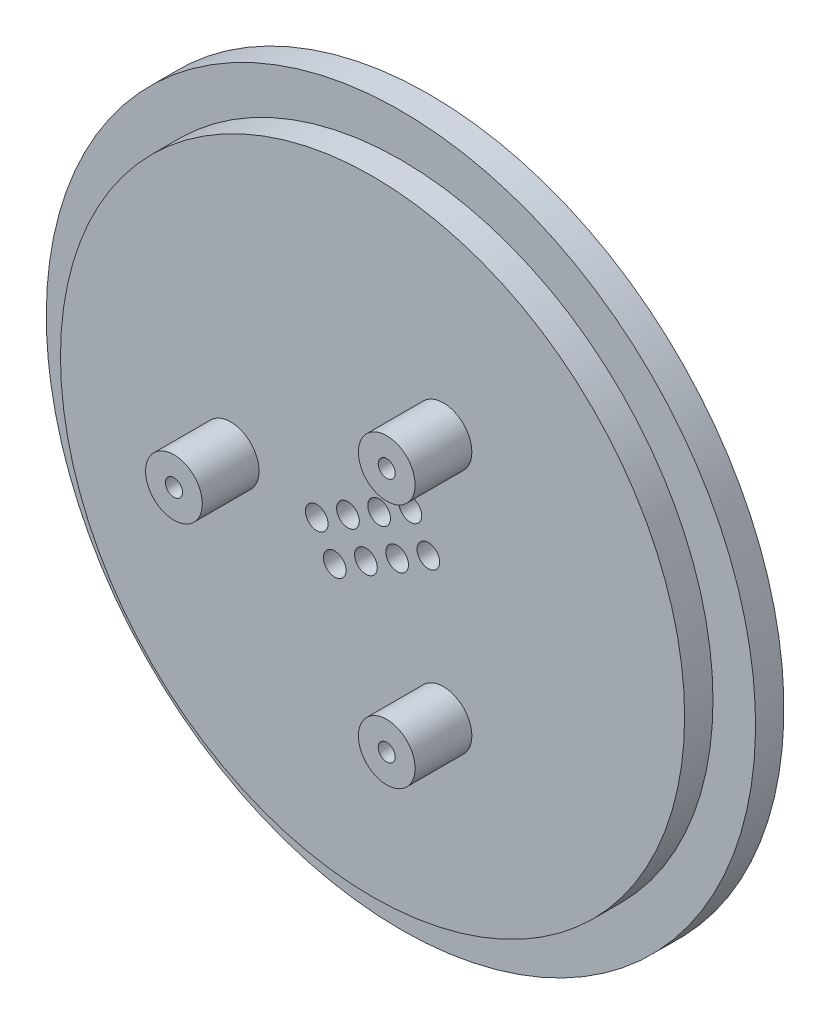
ISO-10303-21;
HEADER;
FILE_DESCRIPTION(('STEP AP214'),'2;1');
FILE_NAME('part.step','',(''),(''),'','','');
FILE_SCHEMA(('AUTOMOTIVE_DESIGN { 1 0 10303 214 1 1 1 1 }'));
ENDSEC;
DATA;
#1=APPLICATION_CONTEXT('core data for automotive mechanical design processes');
#2=APPLICATION_PROTOCOL_DEFINITION('international standard','automotive_design',2000,#1);
#3=PRODUCT_CONTEXT('',#1,'mechanical');
#4=PRODUCT('Part','Part','',(#3));
#5=PRODUCT_RELATED_PRODUCT_CATEGORY('part','',(#4));
#6=PRODUCT_DEFINITION_FORMATION('','',#4);
#7=PRODUCT_DEFINITION_CONTEXT('part definition',#1,'design');
#8=PRODUCT_DEFINITION('design','',#6,#7);
#9=PRODUCT_DEFINITION_SHAPE('','',#8);
#10=(LENGTH_UNIT() NAMED_UNIT(*) SI_UNIT(.MILLI.,.METRE.));
#11=(NAMED_UNIT(*) PLANE_ANGLE_UNIT() SI_UNIT($,.RADIAN.));
#12=(NAMED_UNIT(*) SI_UNIT($,.STERADIAN.) SOLID_ANGLE_UNIT());
#13=UNCERTAINTY_MEASURE_WITH_UNIT(LENGTH_MEASURE(1.E-05),#10,'distance_accuracy_value','');
#14=(GEOMETRIC_REPRESENTATION_CONTEXT(3) GLOBAL_UNCERTAINTY_ASSIGNED_CONTEXT((#13)) GLOBAL_UNIT_ASSIGNED_CONTEXT((#10,
#11,#12)) REPRESENTATION_CONTEXT('',''));
#15=CARTESIAN_POINT('',(0.,0.,0.));
#16=DIRECTION('',(0.,0.,1.));
#17=DIRECTION('',(1.,0.,0.));
#18=AXIS2_PLACEMENT_3D('',#15,#16,#17);
#19=CARTESIAN_POINT('',(-10.,0.,6.));
#20=DIRECTION('',(0.,0.,-1.));
#21=DIRECTION('',(-1.,0.,0.));
#22=AXIS2_PLACEMENT_3D('',#19,#20,#21);
#23=CYLINDRICAL_SURFACE('',#22,0.6);
#24=CARTESIAN_POINT('',(-10.,0.,1.));
#25=DIRECTION('',(0.,0.,-1.));
#26=DIRECTION('',(-1.,0.,0.));
#27=AXIS2_PLACEMENT_3D('',#24,#25,#26);
#28=CIRCLE('',#27,0.6);
#29=CARTESIAN_POINT('',(-10.6,0.,1.));
#30=VERTEX_POINT('',#29);
#31=EDGE_CURVE('E40',#30,#30,#28,.T.);
#32=ORIENTED_EDGE('',*,*,#31,.T.);
#33=EDGE_LOOP('',(#32));
#34=FACE_BOUND('',#33,.T.);
#35=CARTESIAN_POINT('',(-10.,0.,6.));
#36=DIRECTION('',(0.,0.,1.));
#37=DIRECTION('',(1.,0.,0.));
#38=AXIS2_PLACEMENT_3D('',#35,#36,#37);
#39=CIRCLE('',#38,0.6);
#40=CARTESIAN_POINT('',(-9.4,0.,6.));
#41=VERTEX_POINT('',#40);
#42=EDGE_CURVE('E278',#41,#41,#39,.T.);
#43=ORIENTED_EDGE('',*,*,#42,.T.);
#44=EDGE_LOOP('',(#43));
#45=FACE_BOUND('',#44,.T.);
#46=ADVANCED_FACE('F36',(#34,#45),#23,.F.);
#47=CARTESIAN_POINT('',(4.99999999999998,8.6602540378444,6.));
#48=DIRECTION('',(0.,0.,-1.));
#49=DIRECTION('',(-1.,0.,0.));
#50=AXIS2_PLACEMENT_3D('',#47,#48,#49);
#51=CYLINDRICAL_SURFACE('',#50,0.6);
#52=CARTESIAN_POINT('',(4.99999999999998,8.6602540378444,-1.));
#53=DIRECTION('',(0.,0.,-1.));
#54=DIRECTION('',(-1.,0.,0.));
#55=AXIS2_PLACEMENT_3D('',#52,#53,#54);
#56=CIRCLE('',#55,0.6);
#57=CARTESIAN_POINT('',(4.39999999999998,8.6602540378444,-1.));
#58=VERTEX_POINT('',#57);
#59=EDGE_CURVE('E131',#58,#58,#56,.T.);
#60=ORIENTED_EDGE('',*,*,#59,.T.);
#61=EDGE_LOOP('',(#60));
#62=FACE_BOUND('',#61,.T.);
#63=CARTESIAN_POINT('',(4.99999999999998,8.6602540378444,6.));
#64=DIRECTION('',(0.,0.,1.));
#65=DIRECTION('',(1.,0.,0.));
#66=AXIS2_PLACEMENT_3D('',#63,#64,#65);
#67=CIRCLE('',#66,0.599999999999999);
#68=CARTESIAN_POINT('',(5.59999999999998,8.6602540378444,6.));
#69=VERTEX_POINT('',#68);
#70=EDGE_CURVE('E266',#69,#69,#67,.T.);
#71=ORIENTED_EDGE('',*,*,#70,.T.);
#72=EDGE_LOOP('',(#71));
#73=FACE_BOUND('',#72,.T.);
#74=ADVANCED_FACE('F171',(#62,#73),#51,.F.);
#75=CARTESIAN_POINT('',(4.99999999999998,-8.6602540378444,6.));
#76=DIRECTION('',(0.,0.,-1.));
#77=DIRECTION('',(-1.,0.,0.));
#78=AXIS2_PLACEMENT_3D('',#75,#76,#77);
#79=CYLINDRICAL_SURFACE('',#78,0.6);
#80=CARTESIAN_POINT('',(4.99999999999998,-8.6602540378444,-1.));
#81=DIRECTION('',(0.,0.,-1.));
#82=DIRECTION('',(-1.,0.,0.));
#83=AXIS2_PLACEMENT_3D('',#80,#81,#82);
#84=CIRCLE('',#83,0.6);
#85=CARTESIAN_POINT('',(4.39999999999998,-8.6602540378444,-1.));
#86=VERTEX_POINT('',#85);
#87=EDGE_CURVE('E129',#86,#86,#84,.T.);
#88=ORIENTED_EDGE('',*,*,#87,.T.);
#89=EDGE_LOOP('',(#88));
#90=FACE_BOUND('',#89,.T.);
#91=CARTESIAN_POINT('',(4.99999999999998,-8.6602540378444,6.));
#92=DIRECTION('',(0.,0.,1.));
#93=DIRECTION('',(1.,0.,0.));
#94=AXIS2_PLACEMENT_3D('',#91,#92,#93);
#95=CIRCLE('',#94,0.599999999999999);
#96=CARTESIAN_POINT('',(5.59999999999998,-8.6602540378444,6.));
#97=VERTEX_POINT('',#96);
#98=EDGE_CURVE('E267',#97,#97,#95,.T.);
#99=ORIENTED_EDGE('',*,*,#98,.T.);
#100=EDGE_LOOP('',(#99));
#101=FACE_BOUND('',#100,.T.);
#102=ADVANCED_FACE('F177',(#90,#101),#79,.F.);
#103=CARTESIAN_POINT('',(-10.,0.,6.));
#104=DIRECTION('',(0.,0.,-1.));
#105=DIRECTION('',(-1.,0.,0.));
#106=AXIS2_PLACEMENT_3D('',#103,#104,#105);
#107=CYLINDRICAL_SURFACE('',#106,2.);
#108=CARTESIAN_POINT('',(-10.,0.,2.));
#109=DIRECTION('',(0.,0.,1.));
#110=DIRECTION('',(1.,0.,0.));
#111=AXIS2_PLACEMENT_3D('',#108,#109,#110);
#112=CIRCLE('',#111,2.);
#113=CARTESIAN_POINT('',(-8.,0.,2.));
#114=VERTEX_POINT('',#113);
#115=EDGE_CURVE('E120',#114,#114,#112,.T.);
#116=ORIENTED_EDGE('',*,*,#115,.T.);
#117=EDGE_LOOP('',(#116));
#118=FACE_BOUND('',#117,.T.);
#119=CARTESIAN_POINT('',(-10.,0.,6.));
#120=DIRECTION('',(0.,0.,1.));
#121=DIRECTION('',(1.,0.,0.));
#122=AXIS2_PLACEMENT_3D('',#119,#120,#121);
#123=CIRCLE('',#122,2.);
#124=CARTESIAN_POINT('',(-8.,0.,6.));
#125=VERTEX_POINT('',#124);
#126=EDGE_CURVE('E281',#125,#125,#123,.T.);
#127=ORIENTED_EDGE('',*,*,#126,.F.);
#128=EDGE_LOOP('',(#127));
#129=FACE_BOUND('',#128,.T.);
#130=ADVANCED_FACE('F184',(#118,#129),#107,.T.);
#131=CARTESIAN_POINT('',(4.99999999999998,8.6602540378444,6.));
#132=DIRECTION('',(0.,0.,-1.));
#133=DIRECTION('',(-1.,0.,0.));
#134=AXIS2_PLACEMENT_3D('',#131,#132,#133);
#135=CYLINDRICAL_SURFACE('',#134,2.);
#136=CARTESIAN_POINT('',(4.99999999999998,8.6602540378444,2.));
#137=DIRECTION('',(0.,0.,1.));
#138=DIRECTION('',(1.,0.,0.));
#139=AXIS2_PLACEMENT_3D('',#136,#137,#138);
#140=CIRCLE('',#139,2.);
#141=CARTESIAN_POINT('',(6.99999999999998,8.6602540378444,2.));
#142=VERTEX_POINT('',#141);
#143=EDGE_CURVE('E117',#142,#142,#140,.T.);
#144=ORIENTED_EDGE('',*,*,#143,.T.);
#145=EDGE_LOOP('',(#144));
#146=FACE_BOUND('',#145,.T.);
#147=CARTESIAN_POINT('',(4.99999999999998,8.6602540378444,6.));
#148=DIRECTION('',(0.,0.,1.));
#149=DIRECTION('',(1.,0.,0.));
#150=AXIS2_PLACEMENT_3D('',#147,#148,#149);
#151=CIRCLE('',#150,2.);
#152=CARTESIAN_POINT('',(6.99999999999998,8.6602540378444,6.));
#153=VERTEX_POINT('',#152);
#154=EDGE_CURVE('E270',#153,#153,#151,.T.);
#155=ORIENTED_EDGE('',*,*,#154,.F.);
#156=EDGE_LOOP('',(#155));
#157=FACE_BOUND('',#156,.T.);
#158=ADVANCED_FACE('F183',(#146,#157),#135,.T.);
#159=CARTESIAN_POINT('',(4.99999999999998,-8.6602540378444,6.));
#160=DIRECTION('',(0.,0.,-1.));
#161=DIRECTION('',(-1.,0.,0.));
#162=AXIS2_PLACEMENT_3D('',#159,#160,#161);
#163=CYLINDRICAL_SURFACE('',#162,2.);
#164=CARTESIAN_POINT('',(4.99999999999998,-8.6602540378444,2.));
#165=DIRECTION('',(0.,0.,1.));
#166=DIRECTION('',(1.,0.,0.));
#167=AXIS2_PLACEMENT_3D('',#164,#165,#166);
#168=CIRCLE('',#167,2.);
#169=CARTESIAN_POINT('',(6.99999999999998,-8.6602540378444,2.));
#170=VERTEX_POINT('',#169);
#171=EDGE_CURVE('E114',#170,#170,#168,.T.);
#172=ORIENTED_EDGE('',*,*,#171,.T.);
#173=EDGE_LOOP('',(#172));
#174=FACE_BOUND('',#173,.T.);
#175=CARTESIAN_POINT('',(4.99999999999998,-8.6602540378444,6.));
#176=DIRECTION('',(0.,0.,1.));
#177=DIRECTION('',(1.,0.,0.));
#178=AXIS2_PLACEMENT_3D('',#175,#176,#177);
#179=CIRCLE('',#178,2.);
#180=CARTESIAN_POINT('',(6.99999999999998,-8.6602540378444,6.));
#181=VERTEX_POINT('',#180);
#182=EDGE_CURVE('E264',#181,#181,#179,.T.);
#183=ORIENTED_EDGE('',*,*,#182,.F.);
#184=EDGE_LOOP('',(#183));
#185=FACE_BOUND('',#184,.T.);
#186=ADVANCED_FACE('F197',(#174,#185),#163,.T.);
#187=CARTESIAN_POINT('',(0.,0.,2.));
#188=DIRECTION('',(0.,0.,-1.));
#189=DIRECTION('',(-1.,0.,0.));
#190=AXIS2_PLACEMENT_3D('',#187,#188,#189);
#191=CYLINDRICAL_SURFACE('',#190,22.);
#192=CARTESIAN_POINT('',(0.,0.,2.));
#193=DIRECTION('',(0.,0.,1.));
#194=DIRECTION('',(1.,0.,0.));
#195=AXIS2_PLACEMENT_3D('',#192,#193,#194);
#196=CIRCLE('',#195,22.);
#197=CARTESIAN_POINT('',(22.,0.,2.));
#198=VERTEX_POINT('',#197);
#199=EDGE_CURVE('E123',#198,#198,#196,.T.);
#200=ORIENTED_EDGE('',*,*,#199,.F.);
#201=EDGE_LOOP('',(#200));
#202=FACE_BOUND('',#201,.T.);
#203=CARTESIAN_POINT('',(0.,0.,0.));
#204=DIRECTION('',(0.,0.,1.));
#205=DIRECTION('',(1.,0.,0.));
#206=AXIS2_PLACEMENT_3D('',#203,#204,#205);
#207=CIRCLE('',#206,22.);
#208=CARTESIAN_POINT('',(22.,0.,0.));
#209=VERTEX_POINT('',#208);
#210=EDGE_CURVE('E111',#209,#209,#207,.T.);
#211=ORIENTED_EDGE('',*,*,#210,.T.);
#212=EDGE_LOOP('',(#211));
#213=FACE_BOUND('',#212,.T.);
#214=ADVANCED_FACE('F38',(#202,#213),#191,.T.);
#215=CARTESIAN_POINT('',(0.,0.,2.));
#216=DIRECTION('',(0.,0.,1.));
#217=DIRECTION('',(1.,0.,0.));
#218=AXIS2_PLACEMENT_3D('',#215,#216,#217);
#219=PLANE('',#218);
#220=CARTESIAN_POINT('',(1.73485226280621,-0.464852262806249,2.));
#221=DIRECTION('',(0.,0.,1.));
#222=DIRECTION('',(1.,0.,0.));
#223=AXIS2_PLACEMENT_3D('',#220,#221,#222);
#224=CIRCLE('',#223,0.8);
#225=CARTESIAN_POINT('',(2.53485226280621,-0.464852262806249,2.));
#226=VERTEX_POINT('',#225);
#227=EDGE_CURVE('E202',#226,#226,#224,.T.);
#228=ORIENTED_EDGE('',*,*,#227,.F.);
#229=EDGE_LOOP('',(#228));
#230=FACE_BOUND('',#229,.T.);
#231=CARTESIAN_POINT('',(-3.93455678841871,-0.805147737193768,2.));
#232=DIRECTION('',(0.,0.,1.));
#233=DIRECTION('',(1.,0.,0.));
#234=AXIS2_PLACEMENT_3D('',#231,#232,#233);
#235=CIRCLE('',#234,0.799999999999999);
#236=CARTESIAN_POINT('',(-3.13455678841871,-0.805147737193768,2.));
#237=VERTEX_POINT('',#236);
#238=EDGE_CURVE('E206',#237,#237,#235,.T.);
#239=ORIENTED_EDGE('',*,*,#238,.F.);
#240=EDGE_LOOP('',(#239));
#241=FACE_BOUND('',#240,.T.);
#242=CARTESIAN_POINT('',(-1.73485226280624,0.464852262806235,2.));
#243=DIRECTION('',(0.,0.,1.));
#244=DIRECTION('',(1.,0.,0.));
#245=AXIS2_PLACEMENT_3D('',#242,#243,#244);
#246=CIRCLE('',#245,0.8);
#247=CARTESIAN_POINT('',(-0.934852262806237,0.464852262806235,2.));
#248=VERTEX_POINT('',#247);
#249=EDGE_CURVE('E210',#248,#248,#246,.T.);
#250=ORIENTED_EDGE('',*,*,#249,.F.);
#251=EDGE_LOOP('',(#250));
#252=FACE_BOUND('',#251,.T.);
#253=CARTESIAN_POINT('',(0.464852262806235,1.73485226280624,2.));
#254=DIRECTION('',(0.,0.,1.));
#255=DIRECTION('',(1.,0.,0.));
#256=AXIS2_PLACEMENT_3D('',#253,#254,#255);
#257=CIRCLE('',#256,0.8);
#258=CARTESIAN_POINT('',(1.26485226280624,1.73485226280624,2.));
#259=VERTEX_POINT('',#258);
#260=EDGE_CURVE('E214',#259,#259,#257,.T.);
#261=ORIENTED_EDGE('',*,*,#260,.F.);
#262=EDGE_LOOP('',(#261));
#263=FACE_BOUND('',#262,.T.);
#264=CARTESIAN_POINT('',(-0.464852262806259,-1.73485226280625,2.));
#265=DIRECTION('',(0.,0.,1.));
#266=DIRECTION('',(1.,0.,0.));
#267=AXIS2_PLACEMENT_3D('',#264,#265,#266);
#268=CIRCLE('',#267,0.8);
#269=CARTESIAN_POINT('',(0.335147737193741,-1.73485226280625,2.));
#270=VERTEX_POINT('',#269);
#271=EDGE_CURVE('E218',#270,#270,#268,.T.);
#272=ORIENTED_EDGE('',*,*,#271,.F.);
#273=EDGE_LOOP('',(#272));
#274=FACE_BOUND('',#273,.T.);
#275=CARTESIAN_POINT('',(-2.66455678841873,-3.00485226280625,2.));
#276=DIRECTION('',(0.,0.,1.));
#277=DIRECTION('',(1.,0.,0.));
#278=AXIS2_PLACEMENT_3D('',#275,#276,#277);
#279=CIRCLE('',#278,0.8);
#280=CARTESIAN_POINT('',(-1.86455678841873,-3.00485226280625,2.));
#281=VERTEX_POINT('',#280);
#282=EDGE_CURVE('E222',#281,#281,#279,.T.);
#283=ORIENTED_EDGE('',*,*,#282,.F.);
#284=EDGE_LOOP('',(#283));
#285=FACE_BOUND('',#284,.T.);
#286=CARTESIAN_POINT('',(3.93455678841869,0.805147737193754,2.));
#287=DIRECTION('',(0.,0.,1.));
#288=DIRECTION('',(1.,0.,0.));
#289=AXIS2_PLACEMENT_3D('',#286,#287,#288);
#290=CIRCLE('',#289,0.800000000000001);
#291=CARTESIAN_POINT('',(4.73455678841869,0.805147737193754,2.));
#292=VERTEX_POINT('',#291);
#293=EDGE_CURVE('E226',#292,#292,#290,.T.);
#294=ORIENTED_EDGE('',*,*,#293,.F.);
#295=EDGE_LOOP('',(#294));
#296=FACE_BOUND('',#295,.T.);
#297=CARTESIAN_POINT('',(2.66455678841871,3.00485226280624,2.));
#298=DIRECTION('',(0.,0.,1.));
#299=DIRECTION('',(1.,0.,0.));
#300=AXIS2_PLACEMENT_3D('',#297,#298,#299);
#301=CIRCLE('',#300,0.8);
#302=CARTESIAN_POINT('',(3.46455678841871,3.00485226280624,2.));
#303=VERTEX_POINT('',#302);
#304=EDGE_CURVE('E230',#303,#303,#301,.T.);
#305=ORIENTED_EDGE('',*,*,#304,.F.);
#306=EDGE_LOOP('',(#305));
#307=FACE_BOUND('',#306,.T.);
#308=ORIENTED_EDGE('',*,*,#171,.F.);
#309=EDGE_LOOP('',(#308));
#310=FACE_BOUND('',#309,.T.);
#311=ORIENTED_EDGE('',*,*,#143,.F.);
#312=EDGE_LOOP('',(#311));
#313=FACE_BOUND('',#312,.T.);
#314=ORIENTED_EDGE('',*,*,#115,.F.);
#315=EDGE_LOOP('',(#314));
#316=FACE_BOUND('',#315,.T.);
#317=ORIENTED_EDGE('',*,*,#199,.T.);
#318=EDGE_LOOP('',(#317));
#319=FACE_BOUND('',#318,.T.);
#320=ADVANCED_FACE('F187',(#230,#241,#252,#263,#274,#285,#296,#307,#310,#313,#316,#319),#219,.T.);
#321=CARTESIAN_POINT('',(0.,0.,-2.));
#322=DIRECTION('',(0.,0.,1.));
#323=DIRECTION('',(1.,0.,0.));
#324=AXIS2_PLACEMENT_3D('',#321,#322,#323);
#325=CYLINDRICAL_SURFACE('',#324,25.);
#326=CARTESIAN_POINT('',(0.,0.,-1.));
#327=DIRECTION('',(0.,0.,-1.));
#328=DIRECTION('',(-1.,0.,0.));
#329=AXIS2_PLACEMENT_3D('',#326,#327,#328);
#330=CIRCLE('',#329,25.);
#331=CARTESIAN_POINT('',(-24.6779253585061,-4.,-1.));
#332=VERTEX_POINT('',#331);
#333=CARTESIAN_POINT('',(-24.6779253585061,4.,-1.));
#334=VERTEX_POINT('',#333);
#335=EDGE_CURVE('E11',#332,#334,#330,.T.);
#336=ORIENTED_EDGE('',*,*,#335,.F.);
#337=DIRECTION('',(0.,0.,1.));
#338=VECTOR('',#337,1.);
#339=CARTESIAN_POINT('',(-24.6779253585061,-4.,-2.));
#340=LINE('',#339,#338);
#341=CARTESIAN_POINT('',(-24.6779253585061,-4.,-2.));
#342=VERTEX_POINT('',#341);
#343=EDGE_CURVE('E61',#332,#342,#340,.F.);
#344=ORIENTED_EDGE('',*,*,#343,.T.);
#345=CARTESIAN_POINT('',(0.,0.,-2.));
#346=DIRECTION('',(0.,0.,-1.));
#347=DIRECTION('',(-1.,0.,0.));
#348=AXIS2_PLACEMENT_3D('',#345,#346,#347);
#349=CIRCLE('',#348,25.);
#350=CARTESIAN_POINT('',(-24.6779253585061,4.,-2.));
#351=VERTEX_POINT('',#350);
#352=EDGE_CURVE('E108',#351,#342,#349,.T.);
#353=ORIENTED_EDGE('',*,*,#352,.F.);
#354=DIRECTION('',(0.,0.,1.));
#355=VECTOR('',#354,1.);
#356=CARTESIAN_POINT('',(-24.6779253585061,4.,-2.));
#357=LINE('',#356,#355);
#358=EDGE_CURVE('E53',#351,#334,#357,.T.);
#359=ORIENTED_EDGE('',*,*,#358,.T.);
#360=EDGE_LOOP('',(#336,#344,#353,#359));
#361=FACE_BOUND('',#360,.T.);
#362=CARTESIAN_POINT('',(0.,0.,0.));
#363=DIRECTION('',(0.,0.,-1.));
#364=DIRECTION('',(-1.,0.,0.));
#365=AXIS2_PLACEMENT_3D('',#362,#363,#364);
#366=CIRCLE('',#365,25.);
#367=CARTESIAN_POINT('',(-25.,0.,0.));
#368=VERTEX_POINT('',#367);
#369=EDGE_CURVE('E107',#368,#368,#366,.T.);
#370=ORIENTED_EDGE('',*,*,#369,.T.);
#371=EDGE_LOOP('',(#370));
#372=FACE_BOUND('',#371,.T.);
#373=ADVANCED_FACE('F153',(#361,#372),#325,.T.);
#374=CARTESIAN_POINT('',(0.,0.,-2.));
#375=DIRECTION('',(0.,0.,-1.));
#376=DIRECTION('',(-1.,0.,0.));
#377=AXIS2_PLACEMENT_3D('',#374,#375,#376);
#378=PLANE('',#377);
#379=CARTESIAN_POINT('',(1.73485226280621,-0.464852262806249,-2.));
#380=DIRECTION('',(0.,0.,-1.));
#381=DIRECTION('',(-1.,0.,0.));
#382=AXIS2_PLACEMENT_3D('',#379,#380,#381);
#383=CIRCLE('',#382,0.8);
#384=CARTESIAN_POINT('',(0.934852262806215,-0.464852262806249,-2.));
#385=VERTEX_POINT('',#384);
#386=EDGE_CURVE('E442',#385,#385,#383,.T.);
#387=ORIENTED_EDGE('',*,*,#386,.F.);
#388=EDGE_LOOP('',(#387));
#389=FACE_BOUND('',#388,.T.);
#390=CARTESIAN_POINT('',(-3.93455678841871,-0.805147737193768,-2.));
#391=DIRECTION('',(0.,0.,-1.));
#392=DIRECTION('',(-1.,0.,0.));
#393=AXIS2_PLACEMENT_3D('',#390,#391,#392);
#394=CIRCLE('',#393,0.799999999999999);
#395=CARTESIAN_POINT('',(-4.73455678841871,-0.805147737193768,-2.));
#396=VERTEX_POINT('',#395);
#397=EDGE_CURVE('E446',#396,#396,#394,.T.);
#398=ORIENTED_EDGE('',*,*,#397,.F.);
#399=EDGE_LOOP('',(#398));
#400=FACE_BOUND('',#399,.T.);
#401=CARTESIAN_POINT('',(-1.73485226280624,0.464852262806235,-2.));
#402=DIRECTION('',(0.,0.,-1.));
#403=DIRECTION('',(-1.,0.,0.));
#404=AXIS2_PLACEMENT_3D('',#401,#402,#403);
#405=CIRCLE('',#404,0.8);
#406=CARTESIAN_POINT('',(-2.53485226280624,0.464852262806235,-2.));
#407=VERTEX_POINT('',#406);
#408=EDGE_CURVE('E455',#407,#407,#405,.T.);
#409=ORIENTED_EDGE('',*,*,#408,.F.);
#410=EDGE_LOOP('',(#409));
#411=FACE_BOUND('',#410,.T.);
#412=CARTESIAN_POINT('',(0.464852262806235,1.73485226280624,-2.));
#413=DIRECTION('',(0.,0.,-1.));
#414=DIRECTION('',(-1.,0.,0.));
#415=AXIS2_PLACEMENT_3D('',#412,#413,#414);
#416=CIRCLE('',#415,0.8);
#417=CARTESIAN_POINT('',(-0.335147737193765,1.73485226280624,-2.));
#418=VERTEX_POINT('',#417);
#419=EDGE_CURVE('E457',#418,#418,#416,.T.);
#420=ORIENTED_EDGE('',*,*,#419,.F.);
#421=EDGE_LOOP('',(#420));
#422=FACE_BOUND('',#421,.T.);
#423=CARTESIAN_POINT('',(-0.464852262806259,-1.73485226280625,-2.));
#424=DIRECTION('',(0.,0.,-1.));
#425=DIRECTION('',(-1.,0.,0.));
#426=AXIS2_PLACEMENT_3D('',#423,#424,#425);
#427=CIRCLE('',#426,0.8);
#428=CARTESIAN_POINT('',(-1.26485226280626,-1.73485226280625,-2.));
#429=VERTEX_POINT('',#428);
#430=EDGE_CURVE('E440',#429,#429,#427,.T.);
#431=ORIENTED_EDGE('',*,*,#430,.F.);
#432=EDGE_LOOP('',(#431));
#433=FACE_BOUND('',#432,.T.);
#434=CARTESIAN_POINT('',(-2.66455678841873,-3.00485226280625,-2.));
#435=DIRECTION('',(0.,0.,-1.));
#436=DIRECTION('',(-1.,0.,0.));
#437=AXIS2_PLACEMENT_3D('',#434,#435,#436);
#438=CIRCLE('',#437,0.8);
#439=CARTESIAN_POINT('',(-3.46455678841873,-3.00485226280625,-2.));
#440=VERTEX_POINT('',#439);
#441=EDGE_CURVE('E443',#440,#440,#438,.T.);
#442=ORIENTED_EDGE('',*,*,#441,.F.);
#443=EDGE_LOOP('',(#442));
#444=FACE_BOUND('',#443,.T.);
#445=CARTESIAN_POINT('',(3.93455678841869,0.805147737193754,-2.));
#446=DIRECTION('',(0.,0.,-1.));
#447=DIRECTION('',(-1.,0.,0.));
#448=AXIS2_PLACEMENT_3D('',#445,#446,#447);
#449=CIRCLE('',#448,0.800000000000001);
#450=CARTESIAN_POINT('',(3.13455678841869,0.805147737193754,-2.));
#451=VERTEX_POINT('',#450);
#452=EDGE_CURVE('E449',#451,#451,#449,.T.);
#453=ORIENTED_EDGE('',*,*,#452,.F.);
#454=EDGE_LOOP('',(#453));
#455=FACE_BOUND('',#454,.T.);
#456=CARTESIAN_POINT('',(2.66455678841871,3.00485226280624,-2.));
#457=DIRECTION('',(0.,0.,-1.));
#458=DIRECTION('',(-1.,0.,0.));
#459=AXIS2_PLACEMENT_3D('',#456,#457,#458);
#460=CIRCLE('',#459,0.8);
#461=CARTESIAN_POINT('',(1.86455678841871,3.00485226280624,-2.));
#462=VERTEX_POINT('',#461);
#463=EDGE_CURVE('E460',#462,#462,#460,.T.);
#464=ORIENTED_EDGE('',*,*,#463,.F.);
#465=EDGE_LOOP('',(#464));
#466=FACE_BOUND('',#465,.T.);
#467=CARTESIAN_POINT('',(-10.,0.,-2.));
#468=DIRECTION('',(0.,0.,-1.));
#469=DIRECTION('',(-1.,0.,0.));
#470=AXIS2_PLACEMENT_3D('',#467,#468,#469);
#471=CIRCLE('',#470,1.6);
#472=CARTESIAN_POINT('',(-11.6,0.,-2.));
#473=VERTEX_POINT('',#472);
#474=EDGE_CURVE('E284',#473,#473,#471,.T.);
#475=ORIENTED_EDGE('',*,*,#474,.F.);
#476=EDGE_LOOP('',(#475));
#477=FACE_BOUND('',#476,.T.);
#478=CARTESIAN_POINT('',(4.99999999999998,-8.6602540378444,-2.));
#479=DIRECTION('',(0.,0.,-1.));
#480=DIRECTION('',(-1.,0.,0.));
#481=AXIS2_PLACEMENT_3D('',#478,#479,#480);
#482=CIRCLE('',#481,1.6);
#483=CARTESIAN_POINT('',(3.39999999999998,-8.6602540378444,-2.));
#484=VERTEX_POINT('',#483);
#485=EDGE_CURVE('E292',#484,#484,#482,.T.);
#486=ORIENTED_EDGE('',*,*,#485,.F.);
#487=EDGE_LOOP('',(#486));
#488=FACE_BOUND('',#487,.T.);
#489=CARTESIAN_POINT('',(4.99999999999998,8.6602540378444,-2.));
#490=DIRECTION('',(0.,0.,-1.));
#491=DIRECTION('',(-1.,0.,0.));
#492=AXIS2_PLACEMENT_3D('',#489,#490,#491);
#493=CIRCLE('',#492,1.6);
#494=CARTESIAN_POINT('',(3.39999999999998,8.6602540378444,-2.));
#495=VERTEX_POINT('',#494);
#496=EDGE_CURVE('E298',#495,#495,#493,.T.);
#497=ORIENTED_EDGE('',*,*,#496,.F.);
#498=EDGE_LOOP('',(#497));
#499=FACE_BOUND('',#498,.T.);
#500=CARTESIAN_POINT('',(18.,0.,-2.));
#501=DIRECTION('',(0.,0.,-1.));
#502=DIRECTION('',(-1.,0.,0.));
#503=AXIS2_PLACEMENT_3D('',#500,#501,#502);
#504=CIRCLE('',#503,5.45);
#505=CARTESIAN_POINT('',(12.55,0.,-2.));
#506=VERTEX_POINT('',#505);
#507=EDGE_CURVE('E304',#506,#506,#504,.T.);
#508=ORIENTED_EDGE('',*,*,#507,.F.);
#509=EDGE_LOOP('',(#508));
#510=FACE_BOUND('',#509,.T.);
#511=CARTESIAN_POINT('',(-8.99999999999977,15.5884572681203,-2.));
#512=DIRECTION('',(0.,0.,-1.));
#513=DIRECTION('',(-1.,0.,0.));
#514=AXIS2_PLACEMENT_3D('',#511,#512,#513);
#515=CIRCLE('',#514,5.45);
#516=CARTESIAN_POINT('',(-14.4499999999998,15.5884572681203,-2.));
#517=VERTEX_POINT('',#516);
#518=EDGE_CURVE('E316',#517,#517,#515,.T.);
#519=ORIENTED_EDGE('',*,*,#518,.F.);
#520=EDGE_LOOP('',(#519));
#521=FACE_BOUND('',#520,.T.);
#522=CARTESIAN_POINT('',(-9.00000000000023,-15.5884572681195,-2.));
#523=DIRECTION('',(0.,0.,-1.));
#524=DIRECTION('',(-1.,0.,0.));
#525=AXIS2_PLACEMENT_3D('',#522,#523,#524);
#526=CIRCLE('',#525,5.44999999999995);
#527=CARTESIAN_POINT('',(-14.4500000000002,-15.5884572681195,-2.));
#528=VERTEX_POINT('',#527);
#529=EDGE_CURVE('E143',#528,#528,#526,.T.);
#530=ORIENTED_EDGE('',*,*,#529,.F.);
#531=EDGE_LOOP('',(#530));
#532=FACE_BOUND('',#531,.T.);
#533=DIRECTION('',(-1.,0.,0.));
#534=VECTOR('',#533,1.);
#535=CARTESIAN_POINT('',(-21.,-4.,-2.));
#536=LINE('',#535,#534);
#537=CARTESIAN_POINT('',(-21.,-4.,-2.));
#538=VERTEX_POINT('',#537);
#539=EDGE_CURVE('E99',#538,#342,#536,.T.);
#540=ORIENTED_EDGE('',*,*,#539,.F.);
#541=DIRECTION('',(0.,-1.,0.));
#542=VECTOR('',#541,1.);
#543=CARTESIAN_POINT('',(-21.,-3.95,-2.));
#544=LINE('',#543,#542);
#545=CARTESIAN_POINT('',(-21.,4.,-2.));
#546=VERTEX_POINT('',#545);
#547=EDGE_CURVE('E101',#546,#538,#544,.T.);
#548=ORIENTED_EDGE('',*,*,#547,.F.);
#549=DIRECTION('',(1.,0.,0.));
#550=VECTOR('',#549,1.);
#551=CARTESIAN_POINT('',(0.,4.,-2.));
#552=LINE('',#551,#550);
#553=EDGE_CURVE('E45',#351,#546,#552,.T.);
#554=ORIENTED_EDGE('',*,*,#553,.F.);
#555=ORIENTED_EDGE('',*,*,#352,.T.);
#556=EDGE_LOOP('',(#540,#548,#554,#555));
#557=FACE_BOUND('',#556,.T.);
#558=ADVANCED_FACE('F158',(#389,#400,#411,#422,#433,#444,#455,#466,#477,#488,#499,#510,#521,
#532,#557),#378,.T.);
#559=CARTESIAN_POINT('',(0.,0.,0.));
#560=DIRECTION('',(0.,0.,-1.));
#561=DIRECTION('',(-1.,0.,0.));
#562=AXIS2_PLACEMENT_3D('',#559,#560,#561);
#563=PLANE('',#562);
#564=ORIENTED_EDGE('',*,*,#210,.F.);
#565=EDGE_LOOP('',(#564));
#566=FACE_BOUND('',#565,.T.);
#567=ORIENTED_EDGE('',*,*,#369,.F.);
#568=EDGE_LOOP('',(#567));
#569=FACE_BOUND('',#568,.T.);
#570=ADVANCED_FACE('F167',(#566,#569),#563,.F.);
#571=CARTESIAN_POINT('',(0.,0.,-1.));
#572=DIRECTION('',(0.,0.,-1.));
#573=DIRECTION('',(-1.,0.,0.));
#574=AXIS2_PLACEMENT_3D('',#571,#572,#573);
#575=PLANE('',#574);
#576=ORIENTED_EDGE('',*,*,#335,.T.);
#577=DIRECTION('',(1.,0.,0.));
#578=VECTOR('',#577,1.);
#579=CARTESIAN_POINT('',(-29.1490069688256,4.,-1.));
#580=LINE('',#579,#578);
#581=CARTESIAN_POINT('',(-21.,4.,-1.));
#582=VERTEX_POINT('',#581);
#583=EDGE_CURVE('E78',#334,#582,#580,.T.);
#584=ORIENTED_EDGE('',*,*,#583,.T.);
#585=DIRECTION('',(0.,-1.,0.));
#586=VECTOR('',#585,1.);
#587=CARTESIAN_POINT('',(-21.,-3.95,-1.));
#588=LINE('',#587,#586);
#589=CARTESIAN_POINT('',(-21.,-4.,-1.));
#590=VERTEX_POINT('',#589);
#591=EDGE_CURVE('E82',#582,#590,#588,.T.);
#592=ORIENTED_EDGE('',*,*,#591,.T.);
#593=DIRECTION('',(-1.,0.,0.));
#594=VECTOR('',#593,1.);
#595=CARTESIAN_POINT('',(-21.,-4.,-1.));
#596=LINE('',#595,#594);
#597=EDGE_CURVE('E85',#590,#332,#596,.T.);
#598=ORIENTED_EDGE('',*,*,#597,.T.);
#599=EDGE_LOOP('',(#576,#584,#592,#598));
#600=FACE_BOUND('',#599,.T.);
#601=ADVANCED_FACE('F80',(#600),#575,.T.);
#602=CARTESIAN_POINT('',(-21.,-4.,-1.));
#603=DIRECTION('',(0.,-1.,0.));
#604=DIRECTION('',(0.,0.,-1.));
#605=AXIS2_PLACEMENT_3D('',#602,#603,#604);
#606=PLANE('',#605);
#607=ORIENTED_EDGE('',*,*,#597,.F.);
#608=DIRECTION('',(0.,0.,-1.));
#609=VECTOR('',#608,1.);
#610=CARTESIAN_POINT('',(-21.,-4.,-1.));
#611=LINE('',#610,#609);
#612=EDGE_CURVE('E93',#590,#538,#611,.T.);
#613=ORIENTED_EDGE('',*,*,#612,.T.);
#614=ORIENTED_EDGE('',*,*,#539,.T.);
#615=ORIENTED_EDGE('',*,*,#343,.F.);
#616=EDGE_LOOP('',(#607,#613,#614,#615));
#617=FACE_BOUND('',#616,.T.);
#618=ADVANCED_FACE('F159',(#617),#606,.F.);
#619=CARTESIAN_POINT('',(-29.1490069688256,4.,-1.));
#620=DIRECTION('',(0.,1.,0.));
#621=DIRECTION('',(0.,0.,1.));
#622=AXIS2_PLACEMENT_3D('',#619,#620,#621);
#623=PLANE('',#622);
#624=ORIENTED_EDGE('',*,*,#553,.T.);
#625=DIRECTION('',(0.,0.,-1.));
#626=VECTOR('',#625,1.);
#627=CARTESIAN_POINT('',(-21.,4.,-1.));
#628=LINE('',#627,#626);
#629=EDGE_CURVE('E88',#582,#546,#628,.T.);
#630=ORIENTED_EDGE('',*,*,#629,.F.);
#631=ORIENTED_EDGE('',*,*,#583,.F.);
#632=ORIENTED_EDGE('',*,*,#358,.F.);
#633=EDGE_LOOP('',(#624,#630,#631,#632));
#634=FACE_BOUND('',#633,.T.);
#635=ADVANCED_FACE('F89',(#634),#623,.F.);
#636=CARTESIAN_POINT('',(-21.,-3.95,-1.));
#637=DIRECTION('',(1.,0.,0.));
#638=DIRECTION('',(0.,0.,-1.));
#639=AXIS2_PLACEMENT_3D('',#636,#637,#638);
#640=PLANE('',#639);
#641=ORIENTED_EDGE('',*,*,#547,.T.);
#642=ORIENTED_EDGE('',*,*,#612,.F.);
#643=ORIENTED_EDGE('',*,*,#591,.F.);
#644=ORIENTED_EDGE('',*,*,#629,.T.);
#645=EDGE_LOOP('',(#641,#642,#643,#644));
#646=FACE_BOUND('',#645,.T.);
#647=ADVANCED_FACE('F95',(#646),#640,.F.);
#648=CARTESIAN_POINT('',(-9.00000000000023,-15.5884572681195,-0.7));
#649=DIRECTION('',(0.,0.,-1.));
#650=DIRECTION('',(-1.,0.,0.));
#651=AXIS2_PLACEMENT_3D('',#648,#649,#650);
#652=CYLINDRICAL_SURFACE('',#651,5.44999999999995);
#653=CARTESIAN_POINT('',(-9.00000000000023,-15.5884572681195,-0.7));
#654=DIRECTION('',(0.,0.,-1.));
#655=DIRECTION('',(-1.,0.,0.));
#656=AXIS2_PLACEMENT_3D('',#653,#654,#655);
#657=CIRCLE('',#656,5.44999999999995);
#658=CARTESIAN_POINT('',(-14.4500000000002,-15.5884572681195,-0.7));
#659=VERTEX_POINT('',#658);
#660=EDGE_CURVE('E147',#659,#659,#657,.T.);
#661=ORIENTED_EDGE('',*,*,#660,.F.);
#662=EDGE_LOOP('',(#661));
#663=FACE_BOUND('',#662,.T.);
#664=ORIENTED_EDGE('',*,*,#529,.T.);
#665=EDGE_LOOP('',(#664));
#666=FACE_BOUND('',#665,.T.);
#667=ADVANCED_FACE('F328',(#663,#666),#652,.F.);
#668=CARTESIAN_POINT('',(-9.00000000000023,-15.5884572681195,-0.7));
#669=DIRECTION('',(0.,0.,-1.));
#670=DIRECTION('',(-1.,0.,0.));
#671=AXIS2_PLACEMENT_3D('',#668,#669,#670);
#672=PLANE('',#671);
#673=CARTESIAN_POINT('',(-9.00000000000023,-15.5884572681195,-0.7));
#674=DIRECTION('',(0.,0.,-1.));
#675=DIRECTION('',(-1.,0.,0.));
#676=AXIS2_PLACEMENT_3D('',#673,#674,#675);
#677=CIRCLE('',#676,3.85);
#678=CARTESIAN_POINT('',(-12.8500000000002,-15.5884572681195,-0.7));
#679=VERTEX_POINT('',#678);
#680=EDGE_CURVE('E138',#679,#679,#677,.T.);
#681=ORIENTED_EDGE('',*,*,#680,.F.);
#682=EDGE_LOOP('',(#681));
#683=FACE_BOUND('',#682,.T.);
#684=ORIENTED_EDGE('',*,*,#660,.T.);
#685=EDGE_LOOP('',(#684));
#686=FACE_BOUND('',#685,.T.);
#687=ADVANCED_FACE('F330',(#683,#686),#672,.T.);
#688=CARTESIAN_POINT('',(-9.00000000000023,-15.5884572681195,-0.7));
#689=DIRECTION('',(0.,0.,-1.));
#690=DIRECTION('',(-1.,0.,0.));
#691=AXIS2_PLACEMENT_3D('',#688,#689,#690);
#692=CYLINDRICAL_SURFACE('',#691,3.85);
#693=ORIENTED_EDGE('',*,*,#680,.T.);
#694=EDGE_LOOP('',(#693));
#695=FACE_BOUND('',#694,.T.);
#696=CARTESIAN_POINT('',(-9.00000000000023,-15.5884572681195,-2.));
#697=DIRECTION('',(0.,0.,-1.));
#698=DIRECTION('',(-1.,0.,0.));
#699=AXIS2_PLACEMENT_3D('',#696,#697,#698);
#700=CIRCLE('',#699,3.85);
#701=CARTESIAN_POINT('',(-12.8500000000002,-15.5884572681195,-2.));
#702=VERTEX_POINT('',#701);
#703=EDGE_CURVE('E134',#702,#702,#700,.T.);
#704=ORIENTED_EDGE('',*,*,#703,.F.);
#705=EDGE_LOOP('',(#704));
#706=FACE_BOUND('',#705,.T.);
#707=ADVANCED_FACE('F337',(#695,#706),#692,.T.);
#708=CARTESIAN_POINT('',(-8.99999999999977,15.5884572681203,-0.7));
#709=DIRECTION('',(0.,0.,-1.));
#710=DIRECTION('',(-1.,0.,0.));
#711=AXIS2_PLACEMENT_3D('',#708,#709,#710);
#712=CYLINDRICAL_SURFACE('',#711,5.45);
#713=CARTESIAN_POINT('',(-8.99999999999977,15.5884572681203,-0.7));
#714=DIRECTION('',(0.,0.,-1.));
#715=DIRECTION('',(-1.,0.,0.));
#716=AXIS2_PLACEMENT_3D('',#713,#714,#715);
#717=CIRCLE('',#716,5.45);
#718=CARTESIAN_POINT('',(-14.4499999999998,15.5884572681203,-0.7));
#719=VERTEX_POINT('',#718);
#720=EDGE_CURVE('E308',#719,#719,#717,.T.);
#721=ORIENTED_EDGE('',*,*,#720,.F.);
#722=EDGE_LOOP('',(#721));
#723=FACE_BOUND('',#722,.T.);
#724=ORIENTED_EDGE('',*,*,#518,.T.);
#725=EDGE_LOOP('',(#724));
#726=FACE_BOUND('',#725,.T.);
#727=ADVANCED_FACE('F323',(#723,#726),#712,.F.);
#728=CARTESIAN_POINT('',(-8.99999999999977,15.5884572681203,-0.7));
#729=DIRECTION('',(0.,0.,-1.));
#730=DIRECTION('',(-1.,0.,0.));
#731=AXIS2_PLACEMENT_3D('',#728,#729,#730);
#732=PLANE('',#731);
#733=CARTESIAN_POINT('',(-8.99999999999977,15.5884572681203,-0.7));
#734=DIRECTION('',(0.,0.,-1.));
#735=DIRECTION('',(-1.,0.,0.));
#736=AXIS2_PLACEMENT_3D('',#733,#734,#735);
#737=CIRCLE('',#736,3.85);
#738=CARTESIAN_POINT('',(-12.8499999999998,15.5884572681203,-0.7));
#739=VERTEX_POINT('',#738);
#740=EDGE_CURVE('E313',#739,#739,#737,.T.);
#741=ORIENTED_EDGE('',*,*,#740,.F.);
#742=EDGE_LOOP('',(#741));
#743=FACE_BOUND('',#742,.T.);
#744=ORIENTED_EDGE('',*,*,#720,.T.);
#745=EDGE_LOOP('',(#744));
#746=FACE_BOUND('',#745,.T.);
#747=ADVANCED_FACE('F348',(#743,#746),#732,.T.);
#748=CARTESIAN_POINT('',(-8.99999999999977,15.5884572681203,-0.7));
#749=DIRECTION('',(0.,0.,-1.));
#750=DIRECTION('',(-1.,0.,0.));
#751=AXIS2_PLACEMENT_3D('',#748,#749,#750);
#752=CYLINDRICAL_SURFACE('',#751,3.85);
#753=ORIENTED_EDGE('',*,*,#740,.T.);
#754=EDGE_LOOP('',(#753));
#755=FACE_BOUND('',#754,.T.);
#756=CARTESIAN_POINT('',(-8.99999999999977,15.5884572681203,-2.));
#757=DIRECTION('',(0.,0.,-1.));
#758=DIRECTION('',(-1.,0.,0.));
#759=AXIS2_PLACEMENT_3D('',#756,#757,#758);
#760=CIRCLE('',#759,3.85);
#761=CARTESIAN_POINT('',(-12.8499999999998,15.5884572681203,-2.));
#762=VERTEX_POINT('',#761);
#763=EDGE_CURVE('E150',#762,#762,#760,.T.);
#764=ORIENTED_EDGE('',*,*,#763,.F.);
#765=EDGE_LOOP('',(#764));
#766=FACE_BOUND('',#765,.T.);
#767=ADVANCED_FACE('F352',(#755,#766),#752,.T.);
#768=CARTESIAN_POINT('',(18.,0.,-0.7));
#769=DIRECTION('',(0.,0.,-1.));
#770=DIRECTION('',(-1.,0.,0.));
#771=AXIS2_PLACEMENT_3D('',#768,#769,#770);
#772=CYLINDRICAL_SURFACE('',#771,5.45);
#773=CARTESIAN_POINT('',(18.,0.,-0.7));
#774=DIRECTION('',(0.,0.,-1.));
#775=DIRECTION('',(-1.,0.,0.));
#776=AXIS2_PLACEMENT_3D('',#773,#774,#775);
#777=CIRCLE('',#776,5.45);
#778=CARTESIAN_POINT('',(12.55,0.,-0.7));
#779=VERTEX_POINT('',#778);
#780=EDGE_CURVE('E102',#779,#779,#777,.T.);
#781=ORIENTED_EDGE('',*,*,#780,.F.);
#782=EDGE_LOOP('',(#781));
#783=FACE_BOUND('',#782,.T.);
#784=ORIENTED_EDGE('',*,*,#507,.T.);
#785=EDGE_LOOP('',(#784));
#786=FACE_BOUND('',#785,.T.);
#787=ADVANCED_FACE('F356',(#783,#786),#772,.F.);
#788=CARTESIAN_POINT('',(18.,0.,-0.7));
#789=DIRECTION('',(0.,0.,-1.));
#790=DIRECTION('',(-1.,0.,0.));
#791=AXIS2_PLACEMENT_3D('',#788,#789,#790);
#792=PLANE('',#791);
#793=CARTESIAN_POINT('',(18.,0.,-0.7));
#794=DIRECTION('',(0.,0.,-1.));
#795=DIRECTION('',(-1.,0.,0.));
#796=AXIS2_PLACEMENT_3D('',#793,#794,#795);
#797=CIRCLE('',#796,3.85);
#798=CARTESIAN_POINT('',(14.15,0.,-0.7));
#799=VERTEX_POINT('',#798);
#800=EDGE_CURVE('E301',#799,#799,#797,.T.);
#801=ORIENTED_EDGE('',*,*,#800,.F.);
#802=EDGE_LOOP('',(#801));
#803=FACE_BOUND('',#802,.T.);
#804=ORIENTED_EDGE('',*,*,#780,.T.);
#805=EDGE_LOOP('',(#804));
#806=FACE_BOUND('',#805,.T.);
#807=ADVANCED_FACE('F360',(#803,#806),#792,.T.);
#808=CARTESIAN_POINT('',(18.,0.,-0.7));
#809=DIRECTION('',(0.,0.,-1.));
#810=DIRECTION('',(-1.,0.,0.));
#811=AXIS2_PLACEMENT_3D('',#808,#809,#810);
#812=CYLINDRICAL_SURFACE('',#811,3.85);
#813=ORIENTED_EDGE('',*,*,#800,.T.);
#814=EDGE_LOOP('',(#813));
#815=FACE_BOUND('',#814,.T.);
#816=CARTESIAN_POINT('',(18.,0.,-2.));
#817=DIRECTION('',(0.,0.,-1.));
#818=DIRECTION('',(-1.,0.,0.));
#819=AXIS2_PLACEMENT_3D('',#816,#817,#818);
#820=CIRCLE('',#819,3.85);
#821=CARTESIAN_POINT('',(14.15,0.,-2.));
#822=VERTEX_POINT('',#821);
#823=EDGE_CURVE('E305',#822,#822,#820,.T.);
#824=ORIENTED_EDGE('',*,*,#823,.F.);
#825=EDGE_LOOP('',(#824));
#826=FACE_BOUND('',#825,.T.);
#827=ADVANCED_FACE('F364',(#815,#826),#812,.T.);
#828=ORIENTED_EDGE('',*,*,#703,.T.);
#829=EDGE_LOOP('',(#828));
#830=FACE_BOUND('',#829,.T.);
#831=ADVANCED_FACE('F250',(#830),#378,.T.);
#832=ORIENTED_EDGE('',*,*,#763,.T.);
#833=EDGE_LOOP('',(#832));
#834=FACE_BOUND('',#833,.T.);
#835=ADVANCED_FACE('F651',(#834),#378,.T.);
#836=ORIENTED_EDGE('',*,*,#823,.T.);
#837=EDGE_LOOP('',(#836));
#838=FACE_BOUND('',#837,.T.);
#839=ADVANCED_FACE('F249',(#838),#378,.T.);
#840=CARTESIAN_POINT('',(4.99999999999998,8.6602540378444,-1.));
#841=DIRECTION('',(0.,0.,-1.));
#842=DIRECTION('',(-1.,0.,0.));
#843=AXIS2_PLACEMENT_3D('',#840,#841,#842);
#844=CYLINDRICAL_SURFACE('',#843,1.6);
#845=CARTESIAN_POINT('',(4.99999999999998,8.6602540378444,-1.));
#846=DIRECTION('',(0.,0.,-1.));
#847=DIRECTION('',(-1.,0.,0.));
#848=AXIS2_PLACEMENT_3D('',#845,#846,#847);
#849=CIRCLE('',#848,1.6);
#850=CARTESIAN_POINT('',(3.39999999999998,8.6602540378444,-1.));
#851=VERTEX_POINT('',#850);
#852=EDGE_CURVE('E295',#851,#851,#849,.T.);
#853=ORIENTED_EDGE('',*,*,#852,.F.);
#854=EDGE_LOOP('',(#853));
#855=FACE_BOUND('',#854,.T.);
#856=ORIENTED_EDGE('',*,*,#496,.T.);
#857=EDGE_LOOP('',(#856));
#858=FACE_BOUND('',#857,.T.);
#859=ADVANCED_FACE('F369',(#855,#858),#844,.F.);
#860=CARTESIAN_POINT('',(4.99999999999998,8.6602540378444,-1.));
#861=DIRECTION('',(0.,0.,-1.));
#862=DIRECTION('',(-1.,0.,0.));
#863=AXIS2_PLACEMENT_3D('',#860,#861,#862);
#864=PLANE('',#863);
#865=ORIENTED_EDGE('',*,*,#59,.F.);
#866=EDGE_LOOP('',(#865));
#867=FACE_BOUND('',#866,.T.);
#868=ORIENTED_EDGE('',*,*,#852,.T.);
#869=EDGE_LOOP('',(#868));
#870=FACE_BOUND('',#869,.T.);
#871=ADVANCED_FACE('F372',(#867,#870),#864,.T.);
#872=CARTESIAN_POINT('',(4.99999999999998,-8.6602540378444,-1.));
#873=DIRECTION('',(0.,0.,-1.));
#874=DIRECTION('',(-1.,0.,0.));
#875=AXIS2_PLACEMENT_3D('',#872,#873,#874);
#876=CYLINDRICAL_SURFACE('',#875,1.6);
#877=CARTESIAN_POINT('',(4.99999999999998,-8.6602540378444,-1.));
#878=DIRECTION('',(0.,0.,-1.));
#879=DIRECTION('',(-1.,0.,0.));
#880=AXIS2_PLACEMENT_3D('',#877,#878,#879);
#881=CIRCLE('',#880,1.6);
#882=CARTESIAN_POINT('',(3.39999999999998,-8.6602540378444,-1.));
#883=VERTEX_POINT('',#882);
#884=EDGE_CURVE('E132',#883,#883,#881,.T.);
#885=ORIENTED_EDGE('',*,*,#884,.F.);
#886=EDGE_LOOP('',(#885));
#887=FACE_BOUND('',#886,.T.);
#888=ORIENTED_EDGE('',*,*,#485,.T.);
#889=EDGE_LOOP('',(#888));
#890=FACE_BOUND('',#889,.T.);
#891=ADVANCED_FACE('F376',(#887,#890),#876,.F.);
#892=CARTESIAN_POINT('',(4.99999999999998,-8.6602540378444,-1.));
#893=DIRECTION('',(0.,0.,-1.));
#894=DIRECTION('',(-1.,0.,0.));
#895=AXIS2_PLACEMENT_3D('',#892,#893,#894);
#896=PLANE('',#895);
#897=ORIENTED_EDGE('',*,*,#87,.F.);
#898=EDGE_LOOP('',(#897));
#899=FACE_BOUND('',#898,.T.);
#900=ORIENTED_EDGE('',*,*,#884,.T.);
#901=EDGE_LOOP('',(#900));
#902=FACE_BOUND('',#901,.T.);
#903=ADVANCED_FACE('F380',(#899,#902),#896,.T.);
#904=CARTESIAN_POINT('',(-10.,0.,1.));
#905=DIRECTION('',(0.,0.,-1.));
#906=DIRECTION('',(-1.,0.,0.));
#907=AXIS2_PLACEMENT_3D('',#904,#905,#906);
#908=CYLINDRICAL_SURFACE('',#907,1.6);
#909=CARTESIAN_POINT('',(-10.,0.,1.));
#910=DIRECTION('',(0.,0.,-1.));
#911=DIRECTION('',(-1.,0.,0.));
#912=AXIS2_PLACEMENT_3D('',#909,#910,#911);
#913=CIRCLE('',#912,1.6);
#914=CARTESIAN_POINT('',(-11.6,0.,1.));
#915=VERTEX_POINT('',#914);
#916=EDGE_CURVE('E285',#915,#915,#913,.T.);
#917=ORIENTED_EDGE('',*,*,#916,.F.);
#918=EDGE_LOOP('',(#917));
#919=FACE_BOUND('',#918,.T.);
#920=ORIENTED_EDGE('',*,*,#474,.T.);
#921=EDGE_LOOP('',(#920));
#922=FACE_BOUND('',#921,.T.);
#923=ADVANCED_FACE('F384',(#919,#922),#908,.F.);
#924=CARTESIAN_POINT('',(-10.,0.,1.));
#925=DIRECTION('',(0.,0.,-1.));
#926=DIRECTION('',(-1.,0.,0.));
#927=AXIS2_PLACEMENT_3D('',#924,#925,#926);
#928=PLANE('',#927);
#929=ORIENTED_EDGE('',*,*,#31,.F.);
#930=EDGE_LOOP('',(#929));
#931=FACE_BOUND('',#930,.T.);
#932=ORIENTED_EDGE('',*,*,#916,.T.);
#933=EDGE_LOOP('',(#932));
#934=FACE_BOUND('',#933,.T.);
#935=ADVANCED_FACE('F388',(#931,#934),#928,.T.);
#936=CARTESIAN_POINT('',(-10.,0.,6.));
#937=DIRECTION('',(0.,0.,1.));
#938=DIRECTION('',(1.,0.,0.));
#939=AXIS2_PLACEMENT_3D('',#936,#937,#938);
#940=PLANE('',#939);
#941=ORIENTED_EDGE('',*,*,#126,.T.);
#942=EDGE_LOOP('',(#941));
#943=FACE_BOUND('',#942,.T.);
#944=ORIENTED_EDGE('',*,*,#42,.F.);
#945=EDGE_LOOP('',(#944));
#946=FACE_BOUND('',#945,.T.);
#947=ADVANCED_FACE('F392',(#943,#946),#940,.T.);
#948=CARTESIAN_POINT('',(4.99999999999998,8.6602540378444,6.));
#949=DIRECTION('',(0.,0.,1.));
#950=DIRECTION('',(1.,0.,0.));
#951=AXIS2_PLACEMENT_3D('',#948,#949,#950);
#952=PLANE('',#951);
#953=ORIENTED_EDGE('',*,*,#154,.T.);
#954=EDGE_LOOP('',(#953));
#955=FACE_BOUND('',#954,.T.);
#956=ORIENTED_EDGE('',*,*,#70,.F.);
#957=EDGE_LOOP('',(#956));
#958=FACE_BOUND('',#957,.T.);
#959=ADVANCED_FACE('F396',(#955,#958),#952,.T.);
#960=CARTESIAN_POINT('',(4.99999999999998,-8.6602540378444,6.));
#961=DIRECTION('',(0.,0.,1.));
#962=DIRECTION('',(1.,0.,0.));
#963=AXIS2_PLACEMENT_3D('',#960,#961,#962);
#964=PLANE('',#963);
#965=ORIENTED_EDGE('',*,*,#182,.T.);
#966=EDGE_LOOP('',(#965));
#967=FACE_BOUND('',#966,.T.);
#968=ORIENTED_EDGE('',*,*,#98,.F.);
#969=EDGE_LOOP('',(#968));
#970=FACE_BOUND('',#969,.T.);
#971=ADVANCED_FACE('F400',(#967,#970),#964,.T.);
#972=CARTESIAN_POINT('',(2.66455678841871,3.00485226280624,8.));
#973=DIRECTION('',(0.,0.,-1.));
#974=DIRECTION('',(-1.,0.,0.));
#975=AXIS2_PLACEMENT_3D('',#972,#973,#974);
#976=CYLINDRICAL_SURFACE('',#975,0.8);
#977=ORIENTED_EDGE('',*,*,#304,.T.);
#978=EDGE_LOOP('',(#977));
#979=FACE_BOUND('',#978,.T.);
#980=ORIENTED_EDGE('',*,*,#463,.T.);
#981=EDGE_LOOP('',(#980));
#982=FACE_BOUND('',#981,.T.);
#983=ADVANCED_FACE('F404',(#979,#982),#976,.F.);
#984=CARTESIAN_POINT('',(3.93455678841869,0.805147737193754,8.));
#985=DIRECTION('',(0.,0.,-1.));
#986=DIRECTION('',(-1.,0.,0.));
#987=AXIS2_PLACEMENT_3D('',#984,#985,#986);
#988=CYLINDRICAL_SURFACE('',#987,0.800000000000001);
#989=ORIENTED_EDGE('',*,*,#293,.T.);
#990=EDGE_LOOP('',(#989));
#991=FACE_BOUND('',#990,.T.);
#992=ORIENTED_EDGE('',*,*,#452,.T.);
#993=EDGE_LOOP('',(#992));
#994=FACE_BOUND('',#993,.T.);
#995=ADVANCED_FACE('F407',(#991,#994),#988,.F.);
#996=CARTESIAN_POINT('',(-2.66455678841873,-3.00485226280625,8.));
#997=DIRECTION('',(0.,0.,-1.));
#998=DIRECTION('',(-1.,0.,0.));
#999=AXIS2_PLACEMENT_3D('',#996,#997,#998);
#1000=CYLINDRICAL_SURFACE('',#999,0.8);
#1001=ORIENTED_EDGE('',*,*,#282,.T.);
#1002=EDGE_LOOP('',(#1001));
#1003=FACE_BOUND('',#1002,.T.);
#1004=ORIENTED_EDGE('',*,*,#441,.T.);
#1005=EDGE_LOOP('',(#1004));
#1006=FACE_BOUND('',#1005,.T.);
#1007=ADVANCED_FACE('F428',(#1003,#1006),#1000,.F.);
#1008=CARTESIAN_POINT('',(-0.464852262806259,-1.73485226280625,8.));
#1009=DIRECTION('',(0.,0.,-1.));
#1010=DIRECTION('',(-1.,0.,0.));
#1011=AXIS2_PLACEMENT_3D('',#1008,#1009,#1010);
#1012=CYLINDRICAL_SURFACE('',#1011,0.8);
#1013=ORIENTED_EDGE('',*,*,#271,.T.);
#1014=EDGE_LOOP('',(#1013));
#1015=FACE_BOUND('',#1014,.T.);
#1016=ORIENTED_EDGE('',*,*,#430,.T.);
#1017=EDGE_LOOP('',(#1016));
#1018=FACE_BOUND('',#1017,.T.);
#1019=ADVANCED_FACE('F417',(#1015,#1018),#1012,.F.);
#1020=CARTESIAN_POINT('',(0.464852262806235,1.73485226280624,8.));
#1021=DIRECTION('',(0.,0.,-1.));
#1022=DIRECTION('',(-1.,0.,0.));
#1023=AXIS2_PLACEMENT_3D('',#1020,#1021,#1022);
#1024=CYLINDRICAL_SURFACE('',#1023,0.8);
#1025=ORIENTED_EDGE('',*,*,#260,.T.);
#1026=EDGE_LOOP('',(#1025));
#1027=FACE_BOUND('',#1026,.T.);
#1028=ORIENTED_EDGE('',*,*,#419,.T.);
#1029=EDGE_LOOP('',(#1028));
#1030=FACE_BOUND('',#1029,.T.);
#1031=ADVANCED_FACE('F413',(#1027,#1030),#1024,.F.);
#1032=CARTESIAN_POINT('',(-1.73485226280624,0.464852262806235,8.));
#1033=DIRECTION('',(0.,0.,-1.));
#1034=DIRECTION('',(-1.,0.,0.));
#1035=AXIS2_PLACEMENT_3D('',#1032,#1033,#1034);
#1036=CYLINDRICAL_SURFACE('',#1035,0.8);
#1037=ORIENTED_EDGE('',*,*,#249,.T.);
#1038=EDGE_LOOP('',(#1037));
#1039=FACE_BOUND('',#1038,.T.);
#1040=ORIENTED_EDGE('',*,*,#408,.T.);
#1041=EDGE_LOOP('',(#1040));
#1042=FACE_BOUND('',#1041,.T.);
#1043=ADVANCED_FACE('F409',(#1039,#1042),#1036,.F.);
#1044=CARTESIAN_POINT('',(-3.93455678841871,-0.805147737193768,8.));
#1045=DIRECTION('',(0.,0.,-1.));
#1046=DIRECTION('',(-1.,0.,0.));
#1047=AXIS2_PLACEMENT_3D('',#1044,#1045,#1046);
#1048=CYLINDRICAL_SURFACE('',#1047,0.799999999999999);
#1049=ORIENTED_EDGE('',*,*,#238,.T.);
#1050=EDGE_LOOP('',(#1049));
#1051=FACE_BOUND('',#1050,.T.);
#1052=ORIENTED_EDGE('',*,*,#397,.T.);
#1053=EDGE_LOOP('',(#1052));
#1054=FACE_BOUND('',#1053,.T.);
#1055=ADVANCED_FACE('F412',(#1051,#1054),#1048,.F.);
#1056=CARTESIAN_POINT('',(1.73485226280621,-0.464852262806249,8.));
#1057=DIRECTION('',(0.,0.,-1.));
#1058=DIRECTION('',(-1.,0.,0.));
#1059=AXIS2_PLACEMENT_3D('',#1056,#1057,#1058);
#1060=CYLINDRICAL_SURFACE('',#1059,0.8);
#1061=ORIENTED_EDGE('',*,*,#227,.T.);
#1062=EDGE_LOOP('',(#1061));
#1063=FACE_BOUND('',#1062,.T.);
#1064=ORIENTED_EDGE('',*,*,#386,.T.);
#1065=EDGE_LOOP('',(#1064));
#1066=FACE_BOUND('',#1065,.T.);
#1067=ADVANCED_FACE('F419',(#1063,#1066),#1060,.F.);
#1068=CLOSED_SHELL('',(#46,#74,#102,#130,#158,#186,#214,#320,#373,#558,#570,#601,#618,#635,#647,
#667,#687,#707,#727,#747,#767,#787,#807,#827,#831,#835,#839,#859,#871,#891,#903,#923,#935,#947,
#959,#971,#983,#995,#1007,#1019,#1031,#1043,#1055,#1067));
#1069=MANIFOLD_SOLID_BREP('B2',#1068);
#1070=ADVANCED_BREP_SHAPE_REPRESENTATION('',(#18,#1069),#14);
#1071=SHAPE_DEFINITION_REPRESENTATION(#9,#1070);
ENDSEC;
END-ISO-10303-21;
